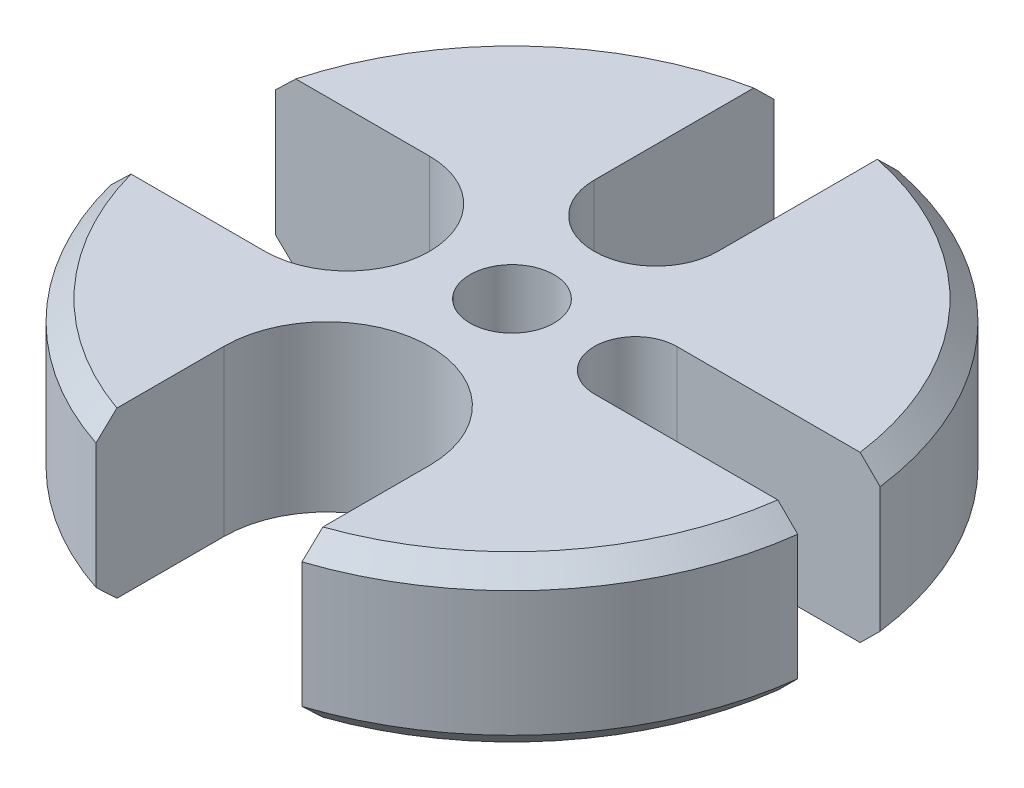
ISO-10303-21;
HEADER;
FILE_DESCRIPTION(('STEP AP214'),'2;1');
FILE_NAME('part.step','',(''),(''),'','','');
FILE_SCHEMA(('AUTOMOTIVE_DESIGN { 1 0 10303 214 1 1 1 1 }'));
ENDSEC;
DATA;
#1=APPLICATION_CONTEXT('core data for automotive mechanical design processes');
#2=APPLICATION_PROTOCOL_DEFINITION('international standard','automotive_design',2000,#1);
#3=PRODUCT_CONTEXT('',#1,'mechanical');
#4=PRODUCT('Part','Part','',(#3));
#5=PRODUCT_RELATED_PRODUCT_CATEGORY('part','',(#4));
#6=PRODUCT_DEFINITION_FORMATION('','',#4);
#7=PRODUCT_DEFINITION_CONTEXT('part definition',#1,'design');
#8=PRODUCT_DEFINITION('design','',#6,#7);
#9=PRODUCT_DEFINITION_SHAPE('','',#8);
#10=(LENGTH_UNIT() NAMED_UNIT(*) SI_UNIT(.MILLI.,.METRE.));
#11=(NAMED_UNIT(*) PLANE_ANGLE_UNIT() SI_UNIT($,.RADIAN.));
#12=(NAMED_UNIT(*) SI_UNIT($,.STERADIAN.) SOLID_ANGLE_UNIT());
#13=UNCERTAINTY_MEASURE_WITH_UNIT(LENGTH_MEASURE(1.E-05),#10,'distance_accuracy_value','');
#14=(GEOMETRIC_REPRESENTATION_CONTEXT(3) GLOBAL_UNCERTAINTY_ASSIGNED_CONTEXT((#13)) GLOBAL_UNIT_ASSIGNED_CONTEXT((#10,
#11,#12)) REPRESENTATION_CONTEXT('',''));
#15=CARTESIAN_POINT('',(0.,0.,0.));
#16=DIRECTION('',(0.,0.,1.));
#17=DIRECTION('',(1.,0.,0.));
#18=AXIS2_PLACEMENT_3D('',#15,#16,#17);
#19=CARTESIAN_POINT('',(0.,12.7,0.));
#20=DIRECTION('',(0.,-1.,0.));
#21=DIRECTION('',(0.,0.,-1.));
#22=AXIS2_PLACEMENT_3D('',#19,#20,#21);
#23=CYLINDRICAL_SURFACE('',#22,25.4);
#24=DIRECTION('',(0.,-1.,0.));
#25=VECTOR('',#24,1.);
#26=CARTESIAN_POINT('',(25.2007812378902,103.503739736549,-3.17500000000027));
#27=LINE('',#26,#25);
#28=CARTESIAN_POINT('',(25.2007812378902,11.176,-3.17500000000027));
#29=VERTEX_POINT('',#28);
#30=CARTESIAN_POINT('',(25.2007812378902,1.52400000000001,-3.17500000000027));
#31=VERTEX_POINT('',#30);
#32=EDGE_CURVE('E228',#29,#31,#27,.T.);
#33=ORIENTED_EDGE('',*,*,#32,.T.);
#34=CARTESIAN_POINT('',(0.,1.524,0.));
#35=DIRECTION('',(0.,1.,0.));
#36=DIRECTION('',(0.,0.,1.));
#37=AXIS2_PLACEMENT_3D('',#34,#35,#36);
#38=CIRCLE('',#37,25.4);
#39=CARTESIAN_POINT('',(4.7625,1.524,-24.949520912234));
#40=VERTEX_POINT('',#39);
#41=EDGE_CURVE('E522',#31,#40,#38,.T.);
#42=ORIENTED_EDGE('',*,*,#41,.T.);
#43=DIRECTION('',(0.,-1.,0.));
#44=VECTOR('',#43,1.);
#45=CARTESIAN_POINT('',(4.7625,103.894932013791,-24.949520912234));
#46=LINE('',#45,#44);
#47=CARTESIAN_POINT('',(4.7625,11.176,-24.949520912234));
#48=VERTEX_POINT('',#47);
#49=EDGE_CURVE('E273',#48,#40,#46,.T.);
#50=ORIENTED_EDGE('',*,*,#49,.F.);
#51=CARTESIAN_POINT('',(0.,11.176,0.));
#52=DIRECTION('',(0.,1.,0.));
#53=DIRECTION('',(0.,0.,1.));
#54=AXIS2_PLACEMENT_3D('',#51,#52,#53);
#55=CIRCLE('',#54,25.4);
#56=EDGE_CURVE('E602',#48,#29,#55,.F.);
#57=ORIENTED_EDGE('',*,*,#56,.T.);
#58=EDGE_LOOP('',(#33,#42,#50,#57));
#59=FACE_BOUND('',#58,.T.);
#60=ADVANCED_FACE('F34',(#59),#23,.T.);
#61=DIRECTION('',(0.,-1.,0.));
#62=VECTOR('',#61,1.);
#63=CARTESIAN_POINT('',(7.9375,103.503739736549,24.1279110937934));
#64=LINE('',#63,#62);
#65=CARTESIAN_POINT('',(7.9375,11.176,24.1279110937934));
#66=VERTEX_POINT('',#65);
#67=CARTESIAN_POINT('',(7.9375,1.524,24.1279110937934));
#68=VERTEX_POINT('',#67);
#69=EDGE_CURVE('E244',#66,#68,#64,.T.);
#70=ORIENTED_EDGE('',*,*,#69,.T.);
#71=CARTESIAN_POINT('',(0.,1.524,0.));
#72=DIRECTION('',(0.,1.,0.));
#73=DIRECTION('',(0.,0.,1.));
#74=AXIS2_PLACEMENT_3D('',#71,#72,#73);
#75=CIRCLE('',#74,25.4);
#76=CARTESIAN_POINT('',(25.2007812378903,1.524,3.17499999999973));
#77=VERTEX_POINT('',#76);
#78=EDGE_CURVE('E528',#68,#77,#75,.T.);
#79=ORIENTED_EDGE('',*,*,#78,.T.);
#80=DIRECTION('',(0.,-1.,0.));
#81=VECTOR('',#80,1.);
#82=CARTESIAN_POINT('',(25.2007812378903,103.503739736549,3.17499999999973));
#83=LINE('',#82,#81);
#84=CARTESIAN_POINT('',(25.2007812378903,11.176,3.17499999999973));
#85=VERTEX_POINT('',#84);
#86=EDGE_CURVE('E219',#85,#77,#83,.T.);
#87=ORIENTED_EDGE('',*,*,#86,.F.);
#88=CARTESIAN_POINT('',(0.,11.176,0.));
#89=DIRECTION('',(0.,1.,0.));
#90=DIRECTION('',(0.,0.,1.));
#91=AXIS2_PLACEMENT_3D('',#88,#89,#90);
#92=CIRCLE('',#91,25.4);
#93=EDGE_CURVE('E525',#85,#66,#92,.F.);
#94=ORIENTED_EDGE('',*,*,#93,.T.);
#95=EDGE_LOOP('',(#70,#79,#87,#94));
#96=FACE_BOUND('',#95,.T.);
#97=ADVANCED_FACE('F429',(#96),#23,.T.);
#98=DIRECTION('',(0.,-1.,0.));
#99=VECTOR('',#98,1.);
#100=CARTESIAN_POINT('',(-24.5934442484171,103.503739736549,6.35000000000009));
#101=LINE('',#100,#99);
#102=CARTESIAN_POINT('',(-24.5934442484171,11.176,6.35000000000009));
#103=VERTEX_POINT('',#102);
#104=CARTESIAN_POINT('',(-24.5934442484171,1.52400000000001,6.35000000000009));
#105=VERTEX_POINT('',#104);
#106=EDGE_CURVE('E263',#103,#105,#101,.T.);
#107=ORIENTED_EDGE('',*,*,#106,.T.);
#108=CARTESIAN_POINT('',(0.,1.524,0.));
#109=DIRECTION('',(0.,1.,0.));
#110=DIRECTION('',(0.,0.,1.));
#111=AXIS2_PLACEMENT_3D('',#108,#109,#110);
#112=CIRCLE('',#111,25.4);
#113=CARTESIAN_POINT('',(-7.9375,1.52400000000001,24.1279110937934));
#114=VERTEX_POINT('',#113);
#115=EDGE_CURVE('E593',#105,#114,#112,.T.);
#116=ORIENTED_EDGE('',*,*,#115,.T.);
#117=DIRECTION('',(0.,-1.,0.));
#118=VECTOR('',#117,1.);
#119=CARTESIAN_POINT('',(-7.9375,103.503739736549,24.1279110937934));
#120=LINE('',#119,#118);
#121=CARTESIAN_POINT('',(-7.9375,11.176,24.1279110937934));
#122=VERTEX_POINT('',#121);
#123=EDGE_CURVE('E235',#122,#114,#120,.T.);
#124=ORIENTED_EDGE('',*,*,#123,.F.);
#125=CARTESIAN_POINT('',(0.,11.176,0.));
#126=DIRECTION('',(0.,1.,0.));
#127=DIRECTION('',(0.,0.,1.));
#128=AXIS2_PLACEMENT_3D('',#125,#126,#127);
#129=CIRCLE('',#128,25.4);
#130=EDGE_CURVE('E592',#122,#103,#129,.F.);
#131=ORIENTED_EDGE('',*,*,#130,.T.);
#132=EDGE_LOOP('',(#107,#116,#124,#131));
#133=FACE_BOUND('',#132,.T.);
#134=ADVANCED_FACE('F437',(#133),#23,.T.);
#135=DIRECTION('',(0.,-1.,0.));
#136=VECTOR('',#135,1.);
#137=CARTESIAN_POINT('',(-4.7625,103.894932013791,-24.949520912234));
#138=LINE('',#137,#136);
#139=CARTESIAN_POINT('',(-4.7625,11.176,-24.949520912234));
#140=VERTEX_POINT('',#139);
#141=CARTESIAN_POINT('',(-4.7625,1.524,-24.949520912234));
#142=VERTEX_POINT('',#141);
#143=EDGE_CURVE('E282',#140,#142,#138,.T.);
#144=ORIENTED_EDGE('',*,*,#143,.T.);
#145=CARTESIAN_POINT('',(0.,1.52399999999999,0.));
#146=DIRECTION('',(0.,1.,0.));
#147=DIRECTION('',(0.,0.,1.));
#148=AXIS2_PLACEMENT_3D('',#145,#146,#147);
#149=CIRCLE('',#148,25.4);
#150=CARTESIAN_POINT('',(-24.5934442484171,1.524,-6.34999999999991));
#151=VERTEX_POINT('',#150);
#152=EDGE_CURVE('E329',#142,#151,#149,.T.);
#153=ORIENTED_EDGE('',*,*,#152,.T.);
#154=DIRECTION('',(0.,-1.,0.));
#155=VECTOR('',#154,1.);
#156=CARTESIAN_POINT('',(-24.5934442484171,103.503739736549,-6.34999999999991));
#157=LINE('',#156,#155);
#158=CARTESIAN_POINT('',(-24.5934442484171,11.176,-6.34999999999991));
#159=VERTEX_POINT('',#158);
#160=EDGE_CURVE('E254',#159,#151,#157,.T.);
#161=ORIENTED_EDGE('',*,*,#160,.F.);
#162=CARTESIAN_POINT('',(0.,11.176,0.));
#163=DIRECTION('',(0.,1.,0.));
#164=DIRECTION('',(0.,0.,1.));
#165=AXIS2_PLACEMENT_3D('',#162,#163,#164);
#166=CIRCLE('',#165,25.4);
#167=EDGE_CURVE('E327',#159,#140,#166,.F.);
#168=ORIENTED_EDGE('',*,*,#167,.T.);
#169=EDGE_LOOP('',(#144,#153,#161,#168));
#170=FACE_BOUND('',#169,.T.);
#171=ADVANCED_FACE('F432',(#170),#23,.T.);
#172=CARTESIAN_POINT('',(0.,12.7,0.));
#173=DIRECTION('',(0.,1.,0.));
#174=DIRECTION('',(0.,0.,1.));
#175=AXIS2_PLACEMENT_3D('',#172,#173,#174);
#176=PLANE('',#175);
#177=DIRECTION('',(0.,0.,1.));
#178=VECTOR('',#177,1.);
#179=CARTESIAN_POINT('',(-4.7625,12.7,0.));
#180=LINE('',#179,#178);
#181=CARTESIAN_POINT('',(-4.7625,12.7,-23.3961956255713));
#182=VERTEX_POINT('',#181);
#183=CARTESIAN_POINT('',(-4.7625,12.7,-11.0998));
#184=VERTEX_POINT('',#183);
#185=EDGE_CURVE('E290',#182,#184,#180,.T.);
#186=ORIENTED_EDGE('',*,*,#185,.F.);
#187=CARTESIAN_POINT('',(0.,12.7,0.));
#188=DIRECTION('',(0.,1.,0.));
#189=DIRECTION('',(0.,0.,1.));
#190=AXIS2_PLACEMENT_3D('',#187,#188,#189);
#191=CIRCLE('',#190,23.876);
#192=CARTESIAN_POINT('',(-23.0161003647447,12.7,-6.34999999999992));
#193=VERTEX_POINT('',#192);
#194=EDGE_CURVE('E11',#182,#193,#191,.T.);
#195=ORIENTED_EDGE('',*,*,#194,.T.);
#196=DIRECTION('',(-1.,0.,0.));
#197=VECTOR('',#196,1.);
#198=CARTESIAN_POINT('',(0.,12.7,-6.35));
#199=LINE('',#198,#197);
#200=CARTESIAN_POINT('',(-12.7,12.7,-6.34999999999996));
#201=VERTEX_POINT('',#200);
#202=EDGE_CURVE('E266',#201,#193,#199,.T.);
#203=ORIENTED_EDGE('',*,*,#202,.F.);
#204=CARTESIAN_POINT('',(-12.7,12.7,0.));
#205=DIRECTION('',(0.,1.,0.));
#206=DIRECTION('',(0.,0.,1.));
#207=AXIS2_PLACEMENT_3D('',#204,#205,#206);
#208=CIRCLE('',#207,6.35);
#209=CARTESIAN_POINT('',(-12.7,12.7,6.35000000000004));
#210=VERTEX_POINT('',#209);
#211=EDGE_CURVE('E269',#210,#201,#208,.T.);
#212=ORIENTED_EDGE('',*,*,#211,.F.);
#213=DIRECTION('',(1.,0.,0.));
#214=VECTOR('',#213,1.);
#215=CARTESIAN_POINT('',(0.,12.7,6.35));
#216=LINE('',#215,#214);
#217=CARTESIAN_POINT('',(-23.0161003647447,12.7,6.35000000000008));
#218=VERTEX_POINT('',#217);
#219=EDGE_CURVE('E271',#218,#210,#216,.T.);
#220=ORIENTED_EDGE('',*,*,#219,.F.);
#221=CARTESIAN_POINT('',(0.,12.7,0.));
#222=DIRECTION('',(0.,1.,0.));
#223=DIRECTION('',(0.,0.,1.));
#224=AXIS2_PLACEMENT_3D('',#221,#222,#223);
#225=CIRCLE('',#224,23.876);
#226=CARTESIAN_POINT('',(-7.9375,12.7,22.5179810318332));
#227=VERTEX_POINT('',#226);
#228=EDGE_CURVE('E386',#218,#227,#225,.T.);
#229=ORIENTED_EDGE('',*,*,#228,.T.);
#230=DIRECTION('',(0.,0.,1.));
#231=VECTOR('',#230,1.);
#232=CARTESIAN_POINT('',(-7.9375,12.7,0.));
#233=LINE('',#232,#231);
#234=CARTESIAN_POINT('',(-7.9375,12.7,14.2748));
#235=VERTEX_POINT('',#234);
#236=EDGE_CURVE('E247',#235,#227,#233,.T.);
#237=ORIENTED_EDGE('',*,*,#236,.F.);
#238=CARTESIAN_POINT('',(0.,12.7,14.2748));
#239=DIRECTION('',(0.,1.,0.));
#240=DIRECTION('',(0.,0.,1.));
#241=AXIS2_PLACEMENT_3D('',#238,#239,#240);
#242=CIRCLE('',#241,7.9375);
#243=CARTESIAN_POINT('',(7.9375,12.7,14.2748));
#244=VERTEX_POINT('',#243);
#245=EDGE_CURVE('E250',#244,#235,#242,.T.);
#246=ORIENTED_EDGE('',*,*,#245,.F.);
#247=DIRECTION('',(0.,0.,-1.));
#248=VECTOR('',#247,1.);
#249=CARTESIAN_POINT('',(7.9375,12.7,0.));
#250=LINE('',#249,#248);
#251=CARTESIAN_POINT('',(7.9375,12.7,22.5179810318332));
#252=VERTEX_POINT('',#251);
#253=EDGE_CURVE('E252',#252,#244,#250,.T.);
#254=ORIENTED_EDGE('',*,*,#253,.F.);
#255=CARTESIAN_POINT('',(0.,12.7,0.));
#256=DIRECTION('',(0.,1.,0.));
#257=DIRECTION('',(0.,0.,1.));
#258=AXIS2_PLACEMENT_3D('',#255,#256,#257);
#259=CIRCLE('',#258,23.876);
#260=CARTESIAN_POINT('',(23.6639546779485,12.7,3.17499999999975));
#261=VERTEX_POINT('',#260);
#262=EDGE_CURVE('E227',#252,#261,#259,.T.);
#263=ORIENTED_EDGE('',*,*,#262,.T.);
#264=DIRECTION('',(1.,0.,0.));
#265=VECTOR('',#264,1.);
#266=CARTESIAN_POINT('',(0.,12.7,3.175));
#267=LINE('',#266,#265);
#268=CARTESIAN_POINT('',(9.52500000000003,12.7,3.1749999999999));
#269=VERTEX_POINT('',#268);
#270=EDGE_CURVE('E211',#269,#261,#267,.T.);
#271=ORIENTED_EDGE('',*,*,#270,.F.);
#272=CARTESIAN_POINT('',(9.525,12.7,0.));
#273=DIRECTION('',(0.,1.,0.));
#274=DIRECTION('',(0.,0.,1.));
#275=AXIS2_PLACEMENT_3D('',#272,#273,#274);
#276=CIRCLE('',#275,3.175);
#277=CARTESIAN_POINT('',(9.52499999999997,12.7,-3.1750000000001));
#278=VERTEX_POINT('',#277);
#279=EDGE_CURVE('E199',#278,#269,#276,.T.);
#280=ORIENTED_EDGE('',*,*,#279,.F.);
#281=DIRECTION('',(-1.,0.,0.));
#282=VECTOR('',#281,1.);
#283=CARTESIAN_POINT('',(0.,12.7,-3.175));
#284=LINE('',#283,#282);
#285=CARTESIAN_POINT('',(23.6639546779484,12.7,-3.17500000000025));
#286=VERTEX_POINT('',#285);
#287=EDGE_CURVE('E210',#286,#278,#284,.T.);
#288=ORIENTED_EDGE('',*,*,#287,.F.);
#289=CARTESIAN_POINT('',(0.,12.7,0.));
#290=DIRECTION('',(0.,1.,0.));
#291=DIRECTION('',(0.,0.,1.));
#292=AXIS2_PLACEMENT_3D('',#289,#290,#291);
#293=CIRCLE('',#292,23.876);
#294=CARTESIAN_POINT('',(4.7625,12.7,-23.3961956255713));
#295=VERTEX_POINT('',#294);
#296=EDGE_CURVE('E43',#286,#295,#293,.T.);
#297=ORIENTED_EDGE('',*,*,#296,.T.);
#298=DIRECTION('',(0.,0.,-1.));
#299=VECTOR('',#298,1.);
#300=CARTESIAN_POINT('',(4.7625,12.7,0.));
#301=LINE('',#300,#299);
#302=CARTESIAN_POINT('',(4.7625,12.7,-11.0998));
#303=VERTEX_POINT('',#302);
#304=EDGE_CURVE('E285',#303,#295,#301,.T.);
#305=ORIENTED_EDGE('',*,*,#304,.F.);
#306=CARTESIAN_POINT('',(0.,12.7,-11.0998));
#307=DIRECTION('',(0.,1.,0.));
#308=DIRECTION('',(0.,0.,1.));
#309=AXIS2_PLACEMENT_3D('',#306,#307,#308);
#310=CIRCLE('',#309,4.7625);
#311=EDGE_CURVE('E288',#184,#303,#310,.T.);
#312=ORIENTED_EDGE('',*,*,#311,.F.);
#313=EDGE_LOOP('',(#186,#195,#203,#212,#220,#229,#237,#246,#254,#263,#271,#280,#288,#297,#305,#312));
#314=FACE_BOUND('',#313,.T.);
#315=CARTESIAN_POINT('',(0.,12.7,0.));
#316=DIRECTION('',(0.,1.,0.));
#317=DIRECTION('',(0.,0.,1.));
#318=AXIS2_PLACEMENT_3D('',#315,#316,#317);
#319=CIRCLE('',#318,3.23850000000001);
#320=CARTESIAN_POINT('',(0.,12.7,3.23850000000001));
#321=VERTEX_POINT('',#320);
#322=EDGE_CURVE('E292',#321,#321,#319,.T.);
#323=ORIENTED_EDGE('',*,*,#322,.F.);
#324=EDGE_LOOP('',(#323));
#325=FACE_BOUND('',#324,.T.);
#326=ADVANCED_FACE('F223',(#314,#325),#176,.T.);
#327=CARTESIAN_POINT('',(0.,0.,0.));
#328=DIRECTION('',(0.,1.,0.));
#329=DIRECTION('',(0.,0.,1.));
#330=AXIS2_PLACEMENT_3D('',#327,#328,#329);
#331=PLANE('',#330);
#332=CARTESIAN_POINT('',(0.,0.,0.));
#333=DIRECTION('',(0.,1.,0.));
#334=DIRECTION('',(0.,0.,1.));
#335=AXIS2_PLACEMENT_3D('',#332,#333,#334);
#336=CIRCLE('',#335,3.23850000000001);
#337=CARTESIAN_POINT('',(0.,0.,3.23850000000001));
#338=VERTEX_POINT('',#337);
#339=EDGE_CURVE('E295',#338,#338,#336,.T.);
#340=ORIENTED_EDGE('',*,*,#339,.T.);
#341=EDGE_LOOP('',(#340));
#342=FACE_BOUND('',#341,.T.);
#343=DIRECTION('',(-1.,0.,0.));
#344=VECTOR('',#343,1.);
#345=CARTESIAN_POINT('',(0.,0.,-6.35));
#346=LINE('',#345,#344);
#347=CARTESIAN_POINT('',(-12.7,0.,-6.34999999999996));
#348=VERTEX_POINT('',#347);
#349=CARTESIAN_POINT('',(-23.0161003647447,0.,-6.34999999999992));
#350=VERTEX_POINT('',#349);
#351=EDGE_CURVE('E306',#348,#350,#346,.T.);
#352=ORIENTED_EDGE('',*,*,#351,.T.);
#353=CARTESIAN_POINT('',(0.,0.,0.));
#354=DIRECTION('',(0.,1.,0.));
#355=DIRECTION('',(0.,0.,1.));
#356=AXIS2_PLACEMENT_3D('',#353,#354,#355);
#357=CIRCLE('',#356,23.876);
#358=CARTESIAN_POINT('',(-4.7625,0.,-23.3961956255713));
#359=VERTEX_POINT('',#358);
#360=EDGE_CURVE('E460',#350,#359,#357,.F.);
#361=ORIENTED_EDGE('',*,*,#360,.T.);
#362=DIRECTION('',(0.,0.,1.));
#363=VECTOR('',#362,1.);
#364=CARTESIAN_POINT('',(-4.7625,0.,0.));
#365=LINE('',#364,#363);
#366=CARTESIAN_POINT('',(-4.7625,0.,-11.0998));
#367=VERTEX_POINT('',#366);
#368=EDGE_CURVE('E304',#359,#367,#365,.T.);
#369=ORIENTED_EDGE('',*,*,#368,.T.);
#370=CARTESIAN_POINT('',(0.,0.,-11.0998));
#371=DIRECTION('',(0.,1.,0.));
#372=DIRECTION('',(0.,0.,1.));
#373=AXIS2_PLACEMENT_3D('',#370,#371,#372);
#374=CIRCLE('',#373,4.7625);
#375=CARTESIAN_POINT('',(4.7625,0.,-11.0998));
#376=VERTEX_POINT('',#375);
#377=EDGE_CURVE('E301',#367,#376,#374,.T.);
#378=ORIENTED_EDGE('',*,*,#377,.T.);
#379=DIRECTION('',(0.,0.,-1.));
#380=VECTOR('',#379,1.);
#381=CARTESIAN_POINT('',(4.7625,0.,0.));
#382=LINE('',#381,#380);
#383=CARTESIAN_POINT('',(4.7625,0.,-23.3961956255712));
#384=VERTEX_POINT('',#383);
#385=EDGE_CURVE('E298',#376,#384,#382,.T.);
#386=ORIENTED_EDGE('',*,*,#385,.T.);
#387=CARTESIAN_POINT('',(0.,0.,0.));
#388=DIRECTION('',(0.,1.,0.));
#389=DIRECTION('',(0.,0.,1.));
#390=AXIS2_PLACEMENT_3D('',#387,#388,#389);
#391=CIRCLE('',#390,23.876);
#392=CARTESIAN_POINT('',(23.6639546779484,0.,-3.17500000000025));
#393=VERTEX_POINT('',#392);
#394=EDGE_CURVE('E466',#384,#393,#391,.F.);
#395=ORIENTED_EDGE('',*,*,#394,.T.);
#396=DIRECTION('',(-1.,0.,0.));
#397=VECTOR('',#396,1.);
#398=CARTESIAN_POINT('',(0.,0.,-3.175));
#399=LINE('',#398,#397);
#400=CARTESIAN_POINT('',(9.52499999999997,0.,-3.1750000000001));
#401=VERTEX_POINT('',#400);
#402=EDGE_CURVE('E325',#393,#401,#399,.T.);
#403=ORIENTED_EDGE('',*,*,#402,.T.);
#404=CARTESIAN_POINT('',(9.525,0.,0.));
#405=DIRECTION('',(0.,1.,0.));
#406=DIRECTION('',(0.,0.,1.));
#407=AXIS2_PLACEMENT_3D('',#404,#405,#406);
#408=CIRCLE('',#407,3.175);
#409=CARTESIAN_POINT('',(9.52500000000003,0.,3.1749999999999));
#410=VERTEX_POINT('',#409);
#411=EDGE_CURVE('E323',#401,#410,#408,.T.);
#412=ORIENTED_EDGE('',*,*,#411,.T.);
#413=DIRECTION('',(1.,0.,0.));
#414=VECTOR('',#413,1.);
#415=CARTESIAN_POINT('',(0.,0.,3.175));
#416=LINE('',#415,#414);
#417=CARTESIAN_POINT('',(23.6639546779485,0.,3.17499999999975));
#418=VERTEX_POINT('',#417);
#419=EDGE_CURVE('E218',#410,#418,#416,.T.);
#420=ORIENTED_EDGE('',*,*,#419,.T.);
#421=CARTESIAN_POINT('',(0.,0.,0.));
#422=DIRECTION('',(0.,1.,0.));
#423=DIRECTION('',(0.,0.,1.));
#424=AXIS2_PLACEMENT_3D('',#421,#422,#423);
#425=CIRCLE('',#424,23.876);
#426=CARTESIAN_POINT('',(7.9375,0.,22.5179810318332));
#427=VERTEX_POINT('',#426);
#428=EDGE_CURVE('E462',#418,#427,#425,.F.);
#429=ORIENTED_EDGE('',*,*,#428,.T.);
#430=DIRECTION('',(0.,0.,-1.));
#431=VECTOR('',#430,1.);
#432=CARTESIAN_POINT('',(7.9375,0.,0.));
#433=LINE('',#432,#431);
#434=CARTESIAN_POINT('',(7.9375,0.,14.2748));
#435=VERTEX_POINT('',#434);
#436=EDGE_CURVE('E320',#427,#435,#433,.T.);
#437=ORIENTED_EDGE('',*,*,#436,.T.);
#438=CARTESIAN_POINT('',(0.,0.,14.2748));
#439=DIRECTION('',(0.,1.,0.));
#440=DIRECTION('',(0.,0.,1.));
#441=AXIS2_PLACEMENT_3D('',#438,#439,#440);
#442=CIRCLE('',#441,7.9375);
#443=CARTESIAN_POINT('',(-7.9375,0.,14.2748));
#444=VERTEX_POINT('',#443);
#445=EDGE_CURVE('E317',#435,#444,#442,.T.);
#446=ORIENTED_EDGE('',*,*,#445,.T.);
#447=DIRECTION('',(0.,0.,1.));
#448=VECTOR('',#447,1.);
#449=CARTESIAN_POINT('',(-7.9375,0.,0.));
#450=LINE('',#449,#448);
#451=CARTESIAN_POINT('',(-7.9375,0.,22.5179810318332));
#452=VERTEX_POINT('',#451);
#453=EDGE_CURVE('E314',#444,#452,#450,.T.);
#454=ORIENTED_EDGE('',*,*,#453,.T.);
#455=CARTESIAN_POINT('',(0.,0.,0.));
#456=DIRECTION('',(0.,1.,0.));
#457=DIRECTION('',(0.,0.,1.));
#458=AXIS2_PLACEMENT_3D('',#455,#456,#457);
#459=CIRCLE('',#458,23.876);
#460=CARTESIAN_POINT('',(-23.0161003647446,0.,6.35000000000008));
#461=VERTEX_POINT('',#460);
#462=EDGE_CURVE('E461',#452,#461,#459,.F.);
#463=ORIENTED_EDGE('',*,*,#462,.T.);
#464=DIRECTION('',(1.,0.,0.));
#465=VECTOR('',#464,1.);
#466=CARTESIAN_POINT('',(0.,0.,6.35));
#467=LINE('',#466,#465);
#468=CARTESIAN_POINT('',(-12.7,0.,6.35000000000004));
#469=VERTEX_POINT('',#468);
#470=EDGE_CURVE('E312',#461,#469,#467,.T.);
#471=ORIENTED_EDGE('',*,*,#470,.T.);
#472=CARTESIAN_POINT('',(-12.7,0.,0.));
#473=DIRECTION('',(0.,1.,0.));
#474=DIRECTION('',(0.,0.,1.));
#475=AXIS2_PLACEMENT_3D('',#472,#473,#474);
#476=CIRCLE('',#475,6.35);
#477=EDGE_CURVE('E309',#469,#348,#476,.T.);
#478=ORIENTED_EDGE('',*,*,#477,.T.);
#479=EDGE_LOOP('',(#352,#361,#369,#378,#386,#395,#403,#412,#420,#429,#437,#446,#454,#463,#471,#478));
#480=FACE_BOUND('',#479,.T.);
#481=ADVANCED_FACE('F446',(#342,#480),#331,.F.);
#482=CARTESIAN_POINT('',(0.,12.7,0.));
#483=DIRECTION('',(0.,1.,0.));
#484=DIRECTION('',(0.,0.,1.));
#485=AXIS2_PLACEMENT_3D('',#482,#483,#484);
#486=CYLINDRICAL_SURFACE('',#485,3.23850000000001);
#487=ORIENTED_EDGE('',*,*,#339,.F.);
#488=EDGE_LOOP('',(#487));
#489=FACE_BOUND('',#488,.T.);
#490=ORIENTED_EDGE('',*,*,#322,.T.);
#491=EDGE_LOOP('',(#490));
#492=FACE_BOUND('',#491,.T.);
#493=ADVANCED_FACE('F488',(#489,#492),#486,.F.);
#494=CARTESIAN_POINT('',(-4.7625,103.894932013791,-24.949520912234));
#495=DIRECTION('',(-1.,0.,0.));
#496=DIRECTION('',(0.,0.,1.));
#497=AXIS2_PLACEMENT_3D('',#494,#495,#496);
#498=PLANE('',#497);
#499=ORIENTED_EDGE('',*,*,#368,.F.);
#500=CARTESIAN_POINT('',(-4.7625,0.,-23.3961956255713));
#501=CARTESIAN_POINT('',(-4.7625,0.253844476634487,-23.6552357620002));
#502=CARTESIAN_POINT('',(-4.7625,0.507766715306332,-23.9141996044642));
#503=CARTESIAN_POINT('',(-4.7625,1.0157667153072,-24.4319747000176));
#504=CARTESIAN_POINT('',(-4.7625,1.26984447663535,-24.6907859531078));
#505=CARTESIAN_POINT('',(-4.7625,1.52399999999999,-24.949520912234));
#506=B_SPLINE_CURVE_WITH_KNOTS('',3,(#500,#501,#502,#503,#504,#505),.UNSPECIFIED.,.F.,.F.,(4,2,
4),(0.,1.08804824110085,2.17609647612947),.UNSPECIFIED.);
#507=EDGE_CURVE('E459',#359,#142,#506,.T.);
#508=ORIENTED_EDGE('',*,*,#507,.T.);
#509=ORIENTED_EDGE('',*,*,#143,.F.);
#510=CARTESIAN_POINT('',(-4.7625,11.176,-24.949520912234));
#511=CARTESIAN_POINT('',(-4.7625,11.4301555233646,-24.6907859531078));
#512=CARTESIAN_POINT('',(-4.7625,11.6842332846928,-24.4319747000176));
#513=CARTESIAN_POINT('',(-4.7625,12.1922332846937,-23.9141996044642));
#514=CARTESIAN_POINT('',(-4.7625,12.4461555233655,-23.6552357620002));
#515=CARTESIAN_POINT('',(-4.7625,12.7,-23.3961956255713));
#516=B_SPLINE_CURVE_WITH_KNOTS('',3,(#510,#511,#512,#513,#514,#515),.UNSPECIFIED.,.F.,.F.,(4,2,
4),(0.,1.08804823502862,2.17609647612947),.UNSPECIFIED.);
#517=EDGE_CURVE('E471',#140,#182,#516,.T.);
#518=ORIENTED_EDGE('',*,*,#517,.T.);
#519=ORIENTED_EDGE('',*,*,#185,.T.);
#520=DIRECTION('',(0.,-1.,0.));
#521=VECTOR('',#520,1.);
#522=CARTESIAN_POINT('',(-4.7625,103.894932013791,-11.0998));
#523=LINE('',#522,#521);
#524=EDGE_CURVE('E279',#184,#367,#523,.T.);
#525=ORIENTED_EDGE('',*,*,#524,.T.);
#526=EDGE_LOOP('',(#499,#508,#509,#518,#519,#525));
#527=FACE_BOUND('',#526,.T.);
#528=ADVANCED_FACE('F483',(#527),#498,.F.);
#529=CARTESIAN_POINT('',(0.,103.894932013791,-11.0998));
#530=DIRECTION('',(0.,-1.,0.));
#531=DIRECTION('',(0.,0.,-1.));
#532=AXIS2_PLACEMENT_3D('',#529,#530,#531);
#533=CYLINDRICAL_SURFACE('',#532,4.7625);
#534=ORIENTED_EDGE('',*,*,#524,.F.);
#535=ORIENTED_EDGE('',*,*,#311,.T.);
#536=DIRECTION('',(0.,-1.,0.));
#537=VECTOR('',#536,1.);
#538=CARTESIAN_POINT('',(4.7625,103.894932013791,-11.0998));
#539=LINE('',#538,#537);
#540=EDGE_CURVE('E276',#303,#376,#539,.T.);
#541=ORIENTED_EDGE('',*,*,#540,.T.);
#542=ORIENTED_EDGE('',*,*,#377,.F.);
#543=EDGE_LOOP('',(#534,#535,#541,#542));
#544=FACE_BOUND('',#543,.T.);
#545=ADVANCED_FACE('F487',(#544),#533,.F.);
#546=CARTESIAN_POINT('',(4.7625,103.894932013791,-24.949520912234));
#547=DIRECTION('',(1.,0.,0.));
#548=DIRECTION('',(0.,0.,-1.));
#549=AXIS2_PLACEMENT_3D('',#546,#547,#548);
#550=PLANE('',#549);
#551=ORIENTED_EDGE('',*,*,#49,.T.);
#552=CARTESIAN_POINT('',(4.7625,1.524,-24.949520912234));
#553=CARTESIAN_POINT('',(4.7625,1.26984447663536,-24.6907859531078));
#554=CARTESIAN_POINT('',(4.7625,1.0157667153072,-24.4319747000176));
#555=CARTESIAN_POINT('',(4.7625,0.507766715306335,-23.9141996044642));
#556=CARTESIAN_POINT('',(4.7625,0.253844476634489,-23.6552357620002));
#557=CARTESIAN_POINT('',(4.7625,0.,-23.3961956255712));
#558=B_SPLINE_CURVE_WITH_KNOTS('',3,(#552,#553,#554,#555,#556,#557),.UNSPECIFIED.,.F.,.F.,(4,2,
4),(0.,1.08804823502862,2.17609647612948),.UNSPECIFIED.);
#559=EDGE_CURVE('E513',#40,#384,#558,.T.);
#560=ORIENTED_EDGE('',*,*,#559,.T.);
#561=ORIENTED_EDGE('',*,*,#385,.F.);
#562=ORIENTED_EDGE('',*,*,#540,.F.);
#563=ORIENTED_EDGE('',*,*,#304,.T.);
#564=CARTESIAN_POINT('',(4.7625,12.7,-23.3961956255713));
#565=CARTESIAN_POINT('',(4.7625,12.4461555233655,-23.6552357620002));
#566=CARTESIAN_POINT('',(4.7625,12.1922332846937,-23.9141996044642));
#567=CARTESIAN_POINT('',(4.7625,11.6842332846928,-24.4319747000176));
#568=CARTESIAN_POINT('',(4.7625,11.4301555233646,-24.6907859531078));
#569=CARTESIAN_POINT('',(4.7625,11.176,-24.949520912234));
#570=B_SPLINE_CURVE_WITH_KNOTS('',3,(#564,#565,#566,#567,#568,#569),.UNSPECIFIED.,.F.,.F.,(4,2,
4),(0.,1.08804824110086,2.17609647612948),.UNSPECIFIED.);
#571=EDGE_CURVE('E550',#295,#48,#570,.T.);
#572=ORIENTED_EDGE('',*,*,#571,.T.);
#573=EDGE_LOOP('',(#551,#560,#561,#562,#563,#572));
#574=FACE_BOUND('',#573,.T.);
#575=ADVANCED_FACE('F369',(#574),#550,.F.);
#576=CARTESIAN_POINT('',(-24.5934442484171,103.503739736549,6.35000000000009));
#577=DIRECTION('',(0.,0.,1.));
#578=DIRECTION('',(1.,0.,0.));
#579=AXIS2_PLACEMENT_3D('',#576,#577,#578);
#580=PLANE('',#579);
#581=ORIENTED_EDGE('',*,*,#470,.F.);
#582=CARTESIAN_POINT('',(-23.0161003647446,0.,6.35000000000008));
#583=CARTESIAN_POINT('',(-23.2792706299277,0.253710599686175,6.35000000000008));
#584=CARTESIAN_POINT('',(-23.542301087389,0.507565900720663,6.35000000000008));
#585=CARTESIAN_POINT('',(-24.0680823819412,1.01556590072609,6.35000000000008));
#586=CARTESIAN_POINT('',(-24.3308332190374,1.2697105996916,6.35000000000009));
#587=CARTESIAN_POINT('',(-24.5934442484171,1.524,6.35000000000009));
#588=B_SPLINE_CURVE_WITH_KNOTS('',3,(#582,#583,#584,#585,#586,#587),.UNSPECIFIED.,.F.,.F.,(4,2,
4),(0.,1.09665300744604,2.19330599433988),.UNSPECIFIED.);
#589=EDGE_CURVE('E380',#461,#105,#588,.T.);
#590=ORIENTED_EDGE('',*,*,#589,.T.);
#591=ORIENTED_EDGE('',*,*,#106,.F.);
#592=CARTESIAN_POINT('',(-24.5934442484171,11.176,6.35000000000009));
#593=CARTESIAN_POINT('',(-24.3308332190374,11.4302894003084,6.35000000000008));
#594=CARTESIAN_POINT('',(-24.0680823819412,11.6844340992739,6.35000000000008));
#595=CARTESIAN_POINT('',(-23.542301087389,12.1924340992793,6.35000000000008));
#596=CARTESIAN_POINT('',(-23.2792706299277,12.4462894003138,6.35000000000008));
#597=CARTESIAN_POINT('',(-23.0161003647447,12.7,6.35000000000008));
#598=B_SPLINE_CURVE_WITH_KNOTS('',3,(#592,#593,#594,#595,#596,#597),.UNSPECIFIED.,.F.,.F.,(4,2,
4),(0.,1.09665298689384,2.19330599433988),.UNSPECIFIED.);
#599=EDGE_CURVE('E50',#103,#218,#598,.T.);
#600=ORIENTED_EDGE('',*,*,#599,.T.);
#601=ORIENTED_EDGE('',*,*,#219,.T.);
#602=DIRECTION('',(0.,-1.,0.));
#603=VECTOR('',#602,1.);
#604=CARTESIAN_POINT('',(-12.7,103.503739736549,6.35000000000004));
#605=LINE('',#604,#603);
#606=EDGE_CURVE('E260',#210,#469,#605,.T.);
#607=ORIENTED_EDGE('',*,*,#606,.T.);
#608=EDGE_LOOP('',(#581,#590,#591,#600,#601,#607));
#609=FACE_BOUND('',#608,.T.);
#610=ADVANCED_FACE('F364',(#609),#580,.F.);
#611=CARTESIAN_POINT('',(-12.7,103.503739736549,0.));
#612=DIRECTION('',(0.,-1.,0.));
#613=DIRECTION('',(0.,0.,-1.));
#614=AXIS2_PLACEMENT_3D('',#611,#612,#613);
#615=CYLINDRICAL_SURFACE('',#614,6.35);
#616=ORIENTED_EDGE('',*,*,#606,.F.);
#617=ORIENTED_EDGE('',*,*,#211,.T.);
#618=DIRECTION('',(0.,-1.,0.));
#619=VECTOR('',#618,1.);
#620=CARTESIAN_POINT('',(-12.7,103.503739736549,-6.34999999999996));
#621=LINE('',#620,#619);
#622=EDGE_CURVE('E257',#201,#348,#621,.T.);
#623=ORIENTED_EDGE('',*,*,#622,.T.);
#624=ORIENTED_EDGE('',*,*,#477,.F.);
#625=EDGE_LOOP('',(#616,#617,#623,#624));
#626=FACE_BOUND('',#625,.T.);
#627=ADVANCED_FACE('F357',(#626),#615,.F.);
#628=CARTESIAN_POINT('',(-24.5934442484171,103.503739736549,-6.34999999999991));
#629=DIRECTION('',(0.,0.,-1.));
#630=DIRECTION('',(-1.,0.,0.));
#631=AXIS2_PLACEMENT_3D('',#628,#629,#630);
#632=PLANE('',#631);
#633=ORIENTED_EDGE('',*,*,#160,.T.);
#634=CARTESIAN_POINT('',(-24.5934442484171,1.52399999999999,-6.34999999999991));
#635=CARTESIAN_POINT('',(-24.3308332190375,1.26971059969159,-6.34999999999991));
#636=CARTESIAN_POINT('',(-24.0680823819413,1.01556590072608,-6.34999999999991));
#637=CARTESIAN_POINT('',(-23.542301087389,0.507565900720659,-6.34999999999992));
#638=CARTESIAN_POINT('',(-23.2792706299278,0.253710599686174,-6.34999999999992));
#639=CARTESIAN_POINT('',(-23.0161003647447,0.,-6.34999999999992));
#640=B_SPLINE_CURVE_WITH_KNOTS('',3,(#634,#635,#636,#637,#638,#639),.UNSPECIFIED.,.F.,.F.,(4,2,
4),(0.,1.09665298689383,2.19330599433987),.UNSPECIFIED.);
#641=EDGE_CURVE('E340',#151,#350,#640,.T.);
#642=ORIENTED_EDGE('',*,*,#641,.T.);
#643=ORIENTED_EDGE('',*,*,#351,.F.);
#644=ORIENTED_EDGE('',*,*,#622,.F.);
#645=ORIENTED_EDGE('',*,*,#202,.T.);
#646=CARTESIAN_POINT('',(-23.0161003647447,12.7,-6.34999999999992));
#647=CARTESIAN_POINT('',(-23.2792706299278,12.4462894003138,-6.34999999999992));
#648=CARTESIAN_POINT('',(-23.542301087389,12.1924340992793,-6.34999999999992));
#649=CARTESIAN_POINT('',(-24.0680823819413,11.6844340992739,-6.34999999999991));
#650=CARTESIAN_POINT('',(-24.3308332190375,11.4302894003084,-6.34999999999991));
#651=CARTESIAN_POINT('',(-24.5934442484171,11.176,-6.34999999999991));
#652=B_SPLINE_CURVE_WITH_KNOTS('',3,(#646,#647,#648,#649,#650,#651),.UNSPECIFIED.,.F.,.F.,(4,2,
4),(0.,1.09665300744603,2.19330599433987),.UNSPECIFIED.);
#653=EDGE_CURVE('E332',#193,#159,#652,.T.);
#654=ORIENTED_EDGE('',*,*,#653,.T.);
#655=EDGE_LOOP('',(#633,#642,#643,#644,#645,#654));
#656=FACE_BOUND('',#655,.T.);
#657=ADVANCED_FACE('F351',(#656),#632,.F.);
#658=CARTESIAN_POINT('',(7.9375,103.503739736549,24.1279110937934));
#659=DIRECTION('',(1.,0.,0.));
#660=DIRECTION('',(0.,0.,-1.));
#661=AXIS2_PLACEMENT_3D('',#658,#659,#660);
#662=PLANE('',#661);
#663=ORIENTED_EDGE('',*,*,#436,.F.);
#664=CARTESIAN_POINT('',(7.9375,0.,22.5179810318332));
#665=CARTESIAN_POINT('',(7.9375,0.253519623520526,22.7867574578074));
#666=CARTESIAN_POINT('',(7.9375,0.507279438434347,23.0553065126107));
#667=CARTESIAN_POINT('',(7.9375,1.01527943845816,23.5919498665749));
#668=CARTESIAN_POINT('',(7.9375,1.26951962354434,23.8600441657584));
#669=CARTESIAN_POINT('',(7.9375,1.524,24.1279110937934));
#670=B_SPLINE_CURVE_WITH_KNOTS('',3,(#664,#665,#666,#667,#668,#669),.UNSPECIFIED.,.F.,.F.,(4,2,
4),(0.,1.10842850311031,2.21685695127738),.UNSPECIFIED.);
#671=EDGE_CURVE('E581',#427,#68,#670,.T.);
#672=ORIENTED_EDGE('',*,*,#671,.T.);
#673=ORIENTED_EDGE('',*,*,#69,.F.);
#674=CARTESIAN_POINT('',(7.9375,11.176,24.1279110937934));
#675=CARTESIAN_POINT('',(7.9375,11.4304803764556,23.8600441657584));
#676=CARTESIAN_POINT('',(7.9375,11.6847205615418,23.5919498665749));
#677=CARTESIAN_POINT('',(7.9375,12.1927205615656,23.0553065126107));
#678=CARTESIAN_POINT('',(7.9375,12.4464803764795,22.7867574578074));
#679=CARTESIAN_POINT('',(7.9375,12.7,22.5179810318332));
#680=B_SPLINE_CURVE_WITH_KNOTS('',3,(#674,#675,#676,#677,#678,#679),.UNSPECIFIED.,.F.,.F.,(4,2,
4),(0.,1.10842844816708,2.21685695127741),.UNSPECIFIED.);
#681=EDGE_CURVE('E575',#66,#252,#680,.T.);
#682=ORIENTED_EDGE('',*,*,#681,.T.);
#683=ORIENTED_EDGE('',*,*,#253,.T.);
#684=DIRECTION('',(0.,-1.,0.));
#685=VECTOR('',#684,1.);
#686=CARTESIAN_POINT('',(7.9375,103.503739736549,14.2748));
#687=LINE('',#686,#685);
#688=EDGE_CURVE('E241',#244,#435,#687,.T.);
#689=ORIENTED_EDGE('',*,*,#688,.T.);
#690=EDGE_LOOP('',(#663,#672,#673,#682,#683,#689));
#691=FACE_BOUND('',#690,.T.);
#692=ADVANCED_FACE('F356',(#691),#662,.F.);
#693=CARTESIAN_POINT('',(0.,103.503739736549,14.2748));
#694=DIRECTION('',(0.,-1.,0.));
#695=DIRECTION('',(0.,0.,-1.));
#696=AXIS2_PLACEMENT_3D('',#693,#694,#695);
#697=CYLINDRICAL_SURFACE('',#696,7.9375);
#698=ORIENTED_EDGE('',*,*,#688,.F.);
#699=ORIENTED_EDGE('',*,*,#245,.T.);
#700=DIRECTION('',(0.,-1.,0.));
#701=VECTOR('',#700,1.);
#702=CARTESIAN_POINT('',(-7.9375,103.503739736549,14.2748));
#703=LINE('',#702,#701);
#704=EDGE_CURVE('E238',#235,#444,#703,.T.);
#705=ORIENTED_EDGE('',*,*,#704,.T.);
#706=ORIENTED_EDGE('',*,*,#445,.F.);
#707=EDGE_LOOP('',(#698,#699,#705,#706));
#708=FACE_BOUND('',#707,.T.);
#709=ADVANCED_FACE('F414',(#708),#697,.F.);
#710=CARTESIAN_POINT('',(-7.9375,103.503739736549,24.1279110937934));
#711=DIRECTION('',(-1.,0.,0.));
#712=DIRECTION('',(0.,0.,1.));
#713=AXIS2_PLACEMENT_3D('',#710,#711,#712);
#714=PLANE('',#713);
#715=ORIENTED_EDGE('',*,*,#123,.T.);
#716=CARTESIAN_POINT('',(-7.9375,1.524,24.1279110937934));
#717=CARTESIAN_POINT('',(-7.9375,1.26951962354434,23.8600441657584));
#718=CARTESIAN_POINT('',(-7.9375,1.01527943845816,23.5919498665749));
#719=CARTESIAN_POINT('',(-7.9375,0.507279438434347,23.0553065126107));
#720=CARTESIAN_POINT('',(-7.9375,0.253519623520525,22.7867574578074));
#721=CARTESIAN_POINT('',(-7.9375,0.,22.5179810318332));
#722=B_SPLINE_CURVE_WITH_KNOTS('',3,(#716,#717,#718,#719,#720,#721),.UNSPECIFIED.,.F.,.F.,(4,2,
4),(0.,1.10842844816708,2.21685695127739),.UNSPECIFIED.);
#723=EDGE_CURVE('E397',#114,#452,#722,.T.);
#724=ORIENTED_EDGE('',*,*,#723,.T.);
#725=ORIENTED_EDGE('',*,*,#453,.F.);
#726=ORIENTED_EDGE('',*,*,#704,.F.);
#727=ORIENTED_EDGE('',*,*,#236,.T.);
#728=CARTESIAN_POINT('',(-7.9375,12.7,22.5179810318332));
#729=CARTESIAN_POINT('',(-7.9375,12.4464803764795,22.7867574578074));
#730=CARTESIAN_POINT('',(-7.9375,12.1927205615656,23.0553065126107));
#731=CARTESIAN_POINT('',(-7.9375,11.6847205615418,23.5919498665749));
#732=CARTESIAN_POINT('',(-7.9375,11.4304803764557,23.8600441657584));
#733=CARTESIAN_POINT('',(-7.9375,11.176,24.1279110937934));
#734=B_SPLINE_CURVE_WITH_KNOTS('',3,(#728,#729,#730,#731,#732,#733),.UNSPECIFIED.,.F.,.F.,(4,2,
4),(0.,1.10842850311031,2.21685695127739),.UNSPECIFIED.);
#735=EDGE_CURVE('E58',#227,#122,#734,.T.);
#736=ORIENTED_EDGE('',*,*,#735,.T.);
#737=EDGE_LOOP('',(#715,#724,#725,#726,#727,#736));
#738=FACE_BOUND('',#737,.T.);
#739=ADVANCED_FACE('F409',(#738),#714,.F.);
#740=CARTESIAN_POINT('',(25.2007812378902,103.503739736549,-3.17500000000027));
#741=DIRECTION('',(0.,0.,-1.));
#742=DIRECTION('',(-1.,0.,0.));
#743=AXIS2_PLACEMENT_3D('',#740,#741,#742);
#744=PLANE('',#743);
#745=ORIENTED_EDGE('',*,*,#402,.F.);
#746=CARTESIAN_POINT('',(23.6639546779484,0.,-3.17500000000025));
#747=CARTESIAN_POINT('',(23.9201588302627,0.253933049163788,-3.17500000000025));
#748=CARTESIAN_POINT('',(24.1763297864826,0.507899573812792,-3.17500000000026));
#749=CARTESIAN_POINT('',(24.6886053064631,1.01589957381286,-3.17500000000026));
#750=CARTESIAN_POINT('',(24.9447098702238,1.26993304916386,-3.17500000000026));
#751=CARTESIAN_POINT('',(25.2007812378902,1.524,-3.17500000000027));
#752=B_SPLINE_CURVE_WITH_KNOTS('',3,(#746,#747,#748,#749,#750,#751),.UNSPECIFIED.,.F.,.F.,(4,2,
4),(0.,1.08217511987489,2.16435023860641),.UNSPECIFIED.);
#753=EDGE_CURVE('E521',#393,#31,#752,.T.);
#754=ORIENTED_EDGE('',*,*,#753,.T.);
#755=ORIENTED_EDGE('',*,*,#32,.F.);
#756=CARTESIAN_POINT('',(25.2007812378902,11.176,-3.17500000000027));
#757=CARTESIAN_POINT('',(24.9447098702238,11.4300669508361,-3.17500000000026));
#758=CARTESIAN_POINT('',(24.6886053064631,11.6841004261871,-3.17500000000026));
#759=CARTESIAN_POINT('',(24.1763297864826,12.1921004261872,-3.17500000000026));
#760=CARTESIAN_POINT('',(23.9201588302627,12.4460669508362,-3.17500000000025));
#761=CARTESIAN_POINT('',(23.6639546779484,12.7,-3.17500000000025));
#762=B_SPLINE_CURVE_WITH_KNOTS('',3,(#756,#757,#758,#759,#760,#761),.UNSPECIFIED.,.F.,.F.,(4,2,
4),(0.,1.08217511873152,2.16435023860641),.UNSPECIFIED.);
#763=EDGE_CURVE('E526',#29,#286,#762,.T.);
#764=ORIENTED_EDGE('',*,*,#763,.T.);
#765=ORIENTED_EDGE('',*,*,#287,.T.);
#766=DIRECTION('',(0.,-1.,0.));
#767=VECTOR('',#766,1.);
#768=CARTESIAN_POINT('',(9.52499999999997,103.503739736549,-3.1750000000001));
#769=LINE('',#768,#767);
#770=EDGE_CURVE('E206',#278,#401,#769,.T.);
#771=ORIENTED_EDGE('',*,*,#770,.T.);
#772=EDGE_LOOP('',(#745,#754,#755,#764,#765,#771));
#773=FACE_BOUND('',#772,.T.);
#774=ADVANCED_FACE('F413',(#773),#744,.F.);
#775=CARTESIAN_POINT('',(9.525,103.503739736549,0.));
#776=DIRECTION('',(0.,-1.,0.));
#777=DIRECTION('',(0.,0.,-1.));
#778=AXIS2_PLACEMENT_3D('',#775,#776,#777);
#779=CYLINDRICAL_SURFACE('',#778,3.175);
#780=ORIENTED_EDGE('',*,*,#770,.F.);
#781=ORIENTED_EDGE('',*,*,#279,.T.);
#782=DIRECTION('',(0.,-1.,0.));
#783=VECTOR('',#782,1.);
#784=CARTESIAN_POINT('',(9.52500000000003,103.503739736549,3.1749999999999));
#785=LINE('',#784,#783);
#786=EDGE_CURVE('E203',#269,#410,#785,.T.);
#787=ORIENTED_EDGE('',*,*,#786,.T.);
#788=ORIENTED_EDGE('',*,*,#411,.F.);
#789=EDGE_LOOP('',(#780,#781,#787,#788));
#790=FACE_BOUND('',#789,.T.);
#791=ADVANCED_FACE('F201',(#790),#779,.F.);
#792=CARTESIAN_POINT('',(25.2007812378903,103.503739736549,3.17499999999973));
#793=DIRECTION('',(0.,0.,1.));
#794=DIRECTION('',(1.,0.,0.));
#795=AXIS2_PLACEMENT_3D('',#792,#793,#794);
#796=PLANE('',#795);
#797=ORIENTED_EDGE('',*,*,#86,.T.);
#798=CARTESIAN_POINT('',(25.2007812378903,1.524,3.17499999999973));
#799=CARTESIAN_POINT('',(24.9447098702238,1.26993304916386,3.17499999999974));
#800=CARTESIAN_POINT('',(24.6886053064632,1.01589957381286,3.17499999999974));
#801=CARTESIAN_POINT('',(24.1763297864827,0.507899573812792,3.17499999999974));
#802=CARTESIAN_POINT('',(23.9201588302628,0.253933049163789,3.17499999999975));
#803=CARTESIAN_POINT('',(23.6639546779485,0.,3.17499999999975));
#804=B_SPLINE_CURVE_WITH_KNOTS('',3,(#798,#799,#800,#801,#802,#803),.UNSPECIFIED.,.F.,.F.,(4,2,
4),(0.,1.08217511873151,2.1643502386064),.UNSPECIFIED.);
#805=EDGE_CURVE('E582',#77,#418,#804,.T.);
#806=ORIENTED_EDGE('',*,*,#805,.T.);
#807=ORIENTED_EDGE('',*,*,#419,.F.);
#808=ORIENTED_EDGE('',*,*,#786,.F.);
#809=ORIENTED_EDGE('',*,*,#270,.T.);
#810=CARTESIAN_POINT('',(23.6639546779485,12.7,3.17499999999975));
#811=CARTESIAN_POINT('',(23.9201588302627,12.4460669508362,3.17499999999975));
#812=CARTESIAN_POINT('',(24.1763297864827,12.1921004261872,3.17499999999974));
#813=CARTESIAN_POINT('',(24.6886053064632,11.6841004261871,3.17499999999974));
#814=CARTESIAN_POINT('',(24.9447098702238,11.4300669508361,3.17499999999974));
#815=CARTESIAN_POINT('',(25.2007812378903,11.176,3.17499999999973));
#816=B_SPLINE_CURVE_WITH_KNOTS('',3,(#810,#811,#812,#813,#814,#815),.UNSPECIFIED.,.F.,.F.,(4,2,
4),(0.,1.0821751198749,2.16435023860642),.UNSPECIFIED.);
#817=EDGE_CURVE('E567',#261,#85,#816,.T.);
#818=ORIENTED_EDGE('',*,*,#817,.T.);
#819=EDGE_LOOP('',(#797,#806,#807,#808,#809,#818));
#820=FACE_BOUND('',#819,.T.);
#821=ADVANCED_FACE('F216',(#820),#796,.F.);
#822=CARTESIAN_POINT('',(0.,1.52399999999999,0.));
#823=DIRECTION('',(0.,1.,0.));
#824=DIRECTION('',(0.,0.,1.));
#825=AXIS2_PLACEMENT_3D('',#822,#823,#824);
#826=CONICAL_SURFACE('',#825,25.4,0.785398163397452);
#827=ORIENTED_EDGE('',*,*,#507,.F.);
#828=ORIENTED_EDGE('',*,*,#360,.F.);
#829=ORIENTED_EDGE('',*,*,#641,.F.);
#830=ORIENTED_EDGE('',*,*,#152,.F.);
#831=EDGE_LOOP('',(#827,#828,#829,#830));
#832=FACE_BOUND('',#831,.T.);
#833=ADVANCED_FACE('F457',(#832),#826,.T.);
#834=CARTESIAN_POINT('',(0.,1.524,0.));
#835=DIRECTION('',(0.,1.,0.));
#836=DIRECTION('',(0.,0.,1.));
#837=AXIS2_PLACEMENT_3D('',#834,#835,#836);
#838=CONICAL_SURFACE('',#837,25.4,0.785398163397453);
#839=ORIENTED_EDGE('',*,*,#753,.F.);
#840=ORIENTED_EDGE('',*,*,#394,.F.);
#841=ORIENTED_EDGE('',*,*,#559,.F.);
#842=ORIENTED_EDGE('',*,*,#41,.F.);
#843=EDGE_LOOP('',(#839,#840,#841,#842));
#844=FACE_BOUND('',#843,.T.);
#845=ADVANCED_FACE('F518',(#844),#838,.T.);
#846=CARTESIAN_POINT('',(0.,1.524,0.));
#847=DIRECTION('',(0.,1.,0.));
#848=DIRECTION('',(0.,0.,1.));
#849=AXIS2_PLACEMENT_3D('',#846,#847,#848);
#850=CONICAL_SURFACE('',#849,25.4,0.78539816339745);
#851=ORIENTED_EDGE('',*,*,#671,.F.);
#852=ORIENTED_EDGE('',*,*,#428,.F.);
#853=ORIENTED_EDGE('',*,*,#805,.F.);
#854=ORIENTED_EDGE('',*,*,#78,.F.);
#855=EDGE_LOOP('',(#851,#852,#853,#854));
#856=FACE_BOUND('',#855,.T.);
#857=ADVANCED_FACE('F392',(#856),#850,.T.);
#858=CARTESIAN_POINT('',(0.,1.524,0.));
#859=DIRECTION('',(0.,1.,0.));
#860=DIRECTION('',(0.,0.,1.));
#861=AXIS2_PLACEMENT_3D('',#858,#859,#860);
#862=CONICAL_SURFACE('',#861,25.4,0.785398163397451);
#863=ORIENTED_EDGE('',*,*,#589,.F.);
#864=ORIENTED_EDGE('',*,*,#462,.F.);
#865=ORIENTED_EDGE('',*,*,#723,.F.);
#866=ORIENTED_EDGE('',*,*,#115,.F.);
#867=EDGE_LOOP('',(#863,#864,#865,#866));
#868=FACE_BOUND('',#867,.T.);
#869=ADVANCED_FACE('F388',(#868),#862,.T.);
#870=CARTESIAN_POINT('',(0.,12.7,0.));
#871=DIRECTION('',(0.,-1.,0.));
#872=DIRECTION('',(0.,0.,-1.));
#873=AXIS2_PLACEMENT_3D('',#870,#871,#872);
#874=CONICAL_SURFACE('',#873,23.876,0.785398163397446);
#875=ORIENTED_EDGE('',*,*,#517,.F.);
#876=ORIENTED_EDGE('',*,*,#167,.F.);
#877=ORIENTED_EDGE('',*,*,#653,.F.);
#878=ORIENTED_EDGE('',*,*,#194,.F.);
#879=EDGE_LOOP('',(#875,#876,#877,#878));
#880=FACE_BOUND('',#879,.T.);
#881=ADVANCED_FACE('F347',(#880),#874,.T.);
#882=CARTESIAN_POINT('',(0.,12.7,0.));
#883=DIRECTION('',(0.,-1.,0.));
#884=DIRECTION('',(0.,0.,-1.));
#885=AXIS2_PLACEMENT_3D('',#882,#883,#884);
#886=CONICAL_SURFACE('',#885,23.876,0.785398163397447);
#887=ORIENTED_EDGE('',*,*,#763,.F.);
#888=ORIENTED_EDGE('',*,*,#56,.F.);
#889=ORIENTED_EDGE('',*,*,#571,.F.);
#890=ORIENTED_EDGE('',*,*,#296,.F.);
#891=EDGE_LOOP('',(#887,#888,#889,#890));
#892=FACE_BOUND('',#891,.T.);
#893=ADVANCED_FACE('F556',(#892),#886,.T.);
#894=CARTESIAN_POINT('',(0.,12.7,0.));
#895=DIRECTION('',(0.,-1.,0.));
#896=DIRECTION('',(0.,0.,-1.));
#897=AXIS2_PLACEMENT_3D('',#894,#895,#896);
#898=CONICAL_SURFACE('',#897,23.876,0.785398163397447);
#899=ORIENTED_EDGE('',*,*,#681,.F.);
#900=ORIENTED_EDGE('',*,*,#93,.F.);
#901=ORIENTED_EDGE('',*,*,#817,.F.);
#902=ORIENTED_EDGE('',*,*,#262,.F.);
#903=EDGE_LOOP('',(#899,#900,#901,#902));
#904=FACE_BOUND('',#903,.T.);
#905=ADVANCED_FACE('F559',(#904),#898,.T.);
#906=CARTESIAN_POINT('',(0.,12.7,0.));
#907=DIRECTION('',(0.,-1.,0.));
#908=DIRECTION('',(0.,0.,-1.));
#909=AXIS2_PLACEMENT_3D('',#906,#907,#908);
#910=CONICAL_SURFACE('',#909,23.876,0.785398163397445);
#911=ORIENTED_EDGE('',*,*,#599,.F.);
#912=ORIENTED_EDGE('',*,*,#130,.F.);
#913=ORIENTED_EDGE('',*,*,#735,.F.);
#914=ORIENTED_EDGE('',*,*,#228,.F.);
#915=EDGE_LOOP('',(#911,#912,#913,#914));
#916=FACE_BOUND('',#915,.T.);
#917=ADVANCED_FACE('F36',(#916),#910,.T.);
#918=CLOSED_SHELL('',(#60,#97,#134,#171,#326,#481,#493,#528,#545,#575,#610,#627,#657,#692,#709,
#739,#774,#791,#821,#833,#845,#857,#869,#881,#893,#905,#917));
#919=MANIFOLD_SOLID_BREP('B2',#918);
#920=ADVANCED_BREP_SHAPE_REPRESENTATION('',(#18,#919),#14);
#921=SHAPE_DEFINITION_REPRESENTATION(#9,#920);
ENDSEC;
END-ISO-10303-21;
